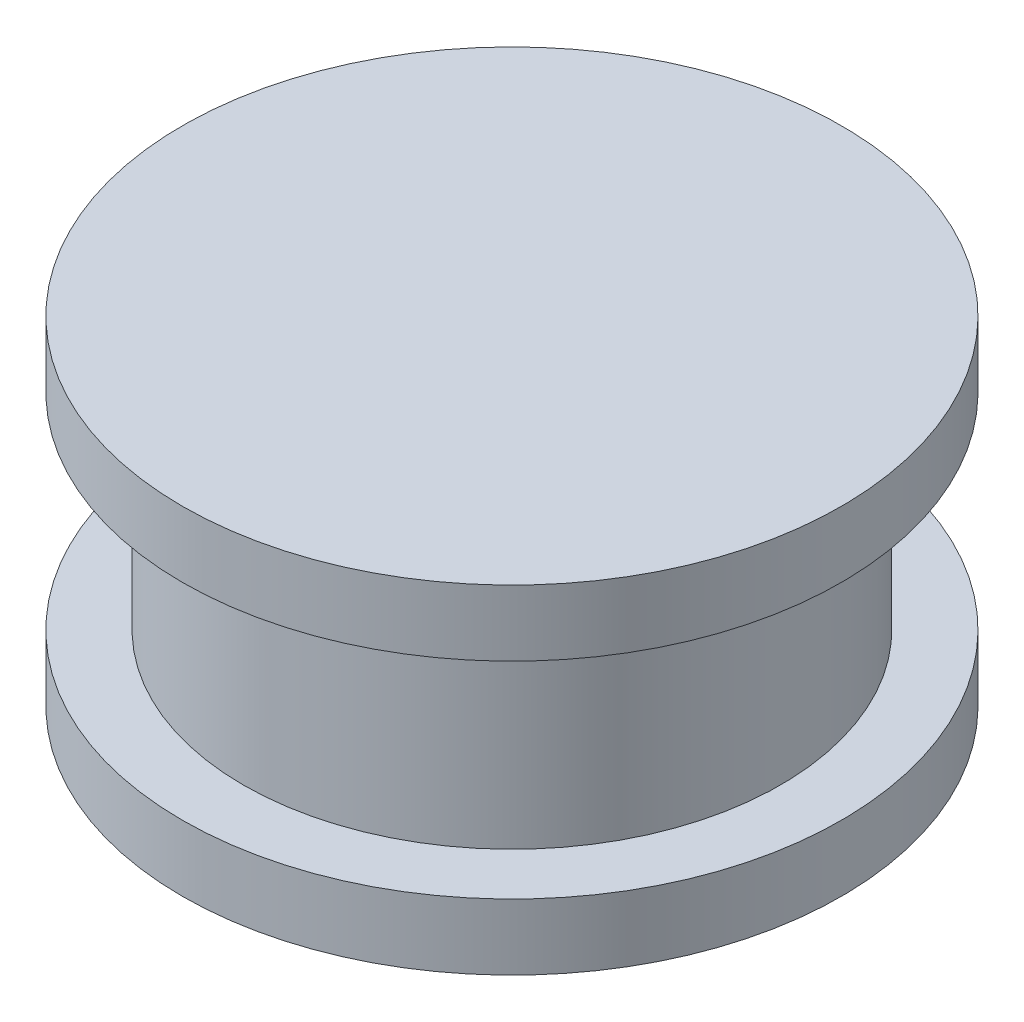
ISO-10303-21;
HEADER;
FILE_DESCRIPTION(('STEP AP214'),'2;1');
FILE_NAME('part.step','',(''),(''),'','','');
FILE_SCHEMA(('AUTOMOTIVE_DESIGN { 1 0 10303 214 1 1 1 1 }'));
ENDSEC;
DATA;
#1=APPLICATION_CONTEXT('core data for automotive mechanical design processes');
#2=APPLICATION_PROTOCOL_DEFINITION('international standard','automotive_design',2000,#1);
#3=PRODUCT_CONTEXT('',#1,'mechanical');
#4=PRODUCT('Part','Part','',(#3));
#5=PRODUCT_RELATED_PRODUCT_CATEGORY('part','',(#4));
#6=PRODUCT_DEFINITION_FORMATION('','',#4);
#7=PRODUCT_DEFINITION_CONTEXT('part definition',#1,'design');
#8=PRODUCT_DEFINITION('design','',#6,#7);
#9=PRODUCT_DEFINITION_SHAPE('','',#8);
#10=(LENGTH_UNIT() NAMED_UNIT(*) SI_UNIT(.MILLI.,.METRE.));
#11=(NAMED_UNIT(*) PLANE_ANGLE_UNIT() SI_UNIT($,.RADIAN.));
#12=(NAMED_UNIT(*) SI_UNIT($,.STERADIAN.) SOLID_ANGLE_UNIT());
#13=UNCERTAINTY_MEASURE_WITH_UNIT(LENGTH_MEASURE(1.E-05),#10,'distance_accuracy_value','');
#14=(GEOMETRIC_REPRESENTATION_CONTEXT(3) GLOBAL_UNCERTAINTY_ASSIGNED_CONTEXT((#13)) GLOBAL_UNIT_ASSIGNED_CONTEXT((#10,
#11,#12)) REPRESENTATION_CONTEXT('',''));
#15=CARTESIAN_POINT('',(0.,0.,0.));
#16=DIRECTION('',(0.,0.,1.));
#17=DIRECTION('',(1.,0.,0.));
#18=AXIS2_PLACEMENT_3D('',#15,#16,#17);
#19=CARTESIAN_POINT('',(0.,0.,0.));
#20=DIRECTION('',(0.,1.,0.));
#21=DIRECTION('',(0.,0.,0.999999999999999));
#22=AXIS2_PLACEMENT_3D('',#19,#20,#21);
#23=PLANE('',#22);
#24=CARTESIAN_POINT('',(0.,0.,0.));
#25=DIRECTION('',(0.,1.,0.));
#26=DIRECTION('',(0.,0.,0.999999999999999));
#27=AXIS2_PLACEMENT_3D('',#24,#25,#26);
#28=CIRCLE('',#27,12.7);
#29=CARTESIAN_POINT('',(0.,0.,12.7));
#30=VERTEX_POINT('',#29);
#31=EDGE_CURVE('E10',#30,#30,#28,.T.);
#32=ORIENTED_EDGE('',*,*,#31,.F.);
#33=EDGE_LOOP('',(#32));
#34=FACE_BOUND('',#33,.T.);
#35=ADVANCED_FACE('F32',(#34),#23,.F.);
#36=CARTESIAN_POINT('',(0.,13.0175,0.));
#37=DIRECTION('',(0.,1.,0.));
#38=DIRECTION('',(0.,0.,0.999999999999999));
#39=AXIS2_PLACEMENT_3D('',#36,#37,#38);
#40=CYLINDRICAL_SURFACE('',#39,12.7);
#41=CARTESIAN_POINT('',(0.,2.53999999999999,0.));
#42=DIRECTION('',(0.,1.,0.));
#43=DIRECTION('',(0.,0.,0.999999999999999));
#44=AXIS2_PLACEMENT_3D('',#41,#42,#43);
#45=CIRCLE('',#44,12.7);
#46=CARTESIAN_POINT('',(0.,2.53999999999999,12.7));
#47=VERTEX_POINT('',#46);
#48=EDGE_CURVE('E38',#47,#47,#45,.T.);
#49=ORIENTED_EDGE('',*,*,#48,.F.);
#50=EDGE_LOOP('',(#49));
#51=FACE_BOUND('',#50,.T.);
#52=ORIENTED_EDGE('',*,*,#31,.T.);
#53=EDGE_LOOP('',(#52));
#54=FACE_BOUND('',#53,.T.);
#55=ADVANCED_FACE('F80',(#51,#54),#40,.T.);
#56=CARTESIAN_POINT('',(12.7,2.53999999999943,0.));
#57=DIRECTION('',(0.,-1.,0.));
#58=DIRECTION('',(0.,0.,-0.999999999999999));
#59=AXIS2_PLACEMENT_3D('',#56,#57,#58);
#60=PLANE('',#59);
#61=CARTESIAN_POINT('',(0.,2.53999999999999,0.));
#62=DIRECTION('',(0.,1.,0.));
#63=DIRECTION('',(0.,0.,0.999999999999999));
#64=AXIS2_PLACEMENT_3D('',#61,#62,#63);
#65=CIRCLE('',#64,10.3505);
#66=CARTESIAN_POINT('',(0.,2.53999999999999,10.3505));
#67=VERTEX_POINT('',#66);
#68=EDGE_CURVE('E42',#67,#67,#65,.T.);
#69=ORIENTED_EDGE('',*,*,#68,.F.);
#70=EDGE_LOOP('',(#69));
#71=FACE_BOUND('',#70,.T.);
#72=ORIENTED_EDGE('',*,*,#48,.T.);
#73=EDGE_LOOP('',(#72));
#74=FACE_BOUND('',#73,.T.);
#75=ADVANCED_FACE('F75',(#71,#74),#60,.F.);
#76=CARTESIAN_POINT('',(0.,13.0175,0.));
#77=DIRECTION('',(0.,1.,0.));
#78=DIRECTION('',(0.,0.,0.999999999999999));
#79=AXIS2_PLACEMENT_3D('',#76,#77,#78);
#80=CYLINDRICAL_SURFACE('',#79,10.3505);
#81=CARTESIAN_POINT('',(0.,10.4775,0.));
#82=DIRECTION('',(0.,1.,0.));
#83=DIRECTION('',(0.,0.,0.999999999999999));
#84=AXIS2_PLACEMENT_3D('',#81,#82,#83);
#85=CIRCLE('',#84,10.3505);
#86=CARTESIAN_POINT('',(0.,10.4775,10.3505));
#87=VERTEX_POINT('',#86);
#88=EDGE_CURVE('E46',#87,#87,#85,.T.);
#89=ORIENTED_EDGE('',*,*,#88,.F.);
#90=EDGE_LOOP('',(#89));
#91=FACE_BOUND('',#90,.T.);
#92=ORIENTED_EDGE('',*,*,#68,.T.);
#93=EDGE_LOOP('',(#92));
#94=FACE_BOUND('',#93,.T.);
#95=ADVANCED_FACE('F69',(#91,#94),#80,.T.);
#96=CARTESIAN_POINT('',(10.3505,10.4774999999994,0.));
#97=DIRECTION('',(0.,1.,0.));
#98=DIRECTION('',(0.,0.,0.999999999999999));
#99=AXIS2_PLACEMENT_3D('',#96,#97,#98);
#100=PLANE('',#99);
#101=CARTESIAN_POINT('',(0.,10.4775,0.));
#102=DIRECTION('',(0.,1.,0.));
#103=DIRECTION('',(0.,0.,0.999999999999999));
#104=AXIS2_PLACEMENT_3D('',#101,#102,#103);
#105=CIRCLE('',#104,12.7);
#106=CARTESIAN_POINT('',(0.,10.4775,12.6999999999999));
#107=VERTEX_POINT('',#106);
#108=EDGE_CURVE('E51',#107,#107,#105,.T.);
#109=ORIENTED_EDGE('',*,*,#108,.F.);
#110=EDGE_LOOP('',(#109));
#111=FACE_BOUND('',#110,.T.);
#112=ORIENTED_EDGE('',*,*,#88,.T.);
#113=EDGE_LOOP('',(#112));
#114=FACE_BOUND('',#113,.T.);
#115=ADVANCED_FACE('F63',(#111,#114),#100,.F.);
#116=CARTESIAN_POINT('',(0.,13.0175,0.));
#117=DIRECTION('',(0.,1.,0.));
#118=DIRECTION('',(0.,0.,0.999999999999999));
#119=AXIS2_PLACEMENT_3D('',#116,#117,#118);
#120=CYLINDRICAL_SURFACE('',#119,12.7);
#121=CARTESIAN_POINT('',(0.,13.0175,0.));
#122=DIRECTION('',(0.,1.,0.));
#123=DIRECTION('',(0.,0.,0.999999999999999));
#124=AXIS2_PLACEMENT_3D('',#121,#122,#123);
#125=CIRCLE('',#124,12.7);
#126=CARTESIAN_POINT('',(0.,13.0175,12.6999999999999));
#127=VERTEX_POINT('',#126);
#128=EDGE_CURVE('E54',#127,#127,#125,.T.);
#129=ORIENTED_EDGE('',*,*,#128,.F.);
#130=EDGE_LOOP('',(#129));
#131=FACE_BOUND('',#130,.T.);
#132=ORIENTED_EDGE('',*,*,#108,.T.);
#133=EDGE_LOOP('',(#132));
#134=FACE_BOUND('',#133,.T.);
#135=ADVANCED_FACE('F60',(#131,#134),#120,.T.);
#136=CARTESIAN_POINT('',(12.7,13.0174999999994,0.));
#137=DIRECTION('',(0.,-1.,0.));
#138=DIRECTION('',(0.,0.,-0.999999999999999));
#139=AXIS2_PLACEMENT_3D('',#136,#137,#138);
#140=PLANE('',#139);
#141=ORIENTED_EDGE('',*,*,#128,.T.);
#142=EDGE_LOOP('',(#141));
#143=FACE_BOUND('',#142,.T.);
#144=ADVANCED_FACE('F58',(#143),#140,.F.);
#145=CLOSED_SHELL('',(#35,#55,#75,#95,#115,#135,#144));
#146=MANIFOLD_SOLID_BREP('B2',#145);
#147=ADVANCED_BREP_SHAPE_REPRESENTATION('',(#18,#146),#14);
#148=SHAPE_DEFINITION_REPRESENTATION(#9,#147);
ENDSEC;
END-ISO-10303-21;
